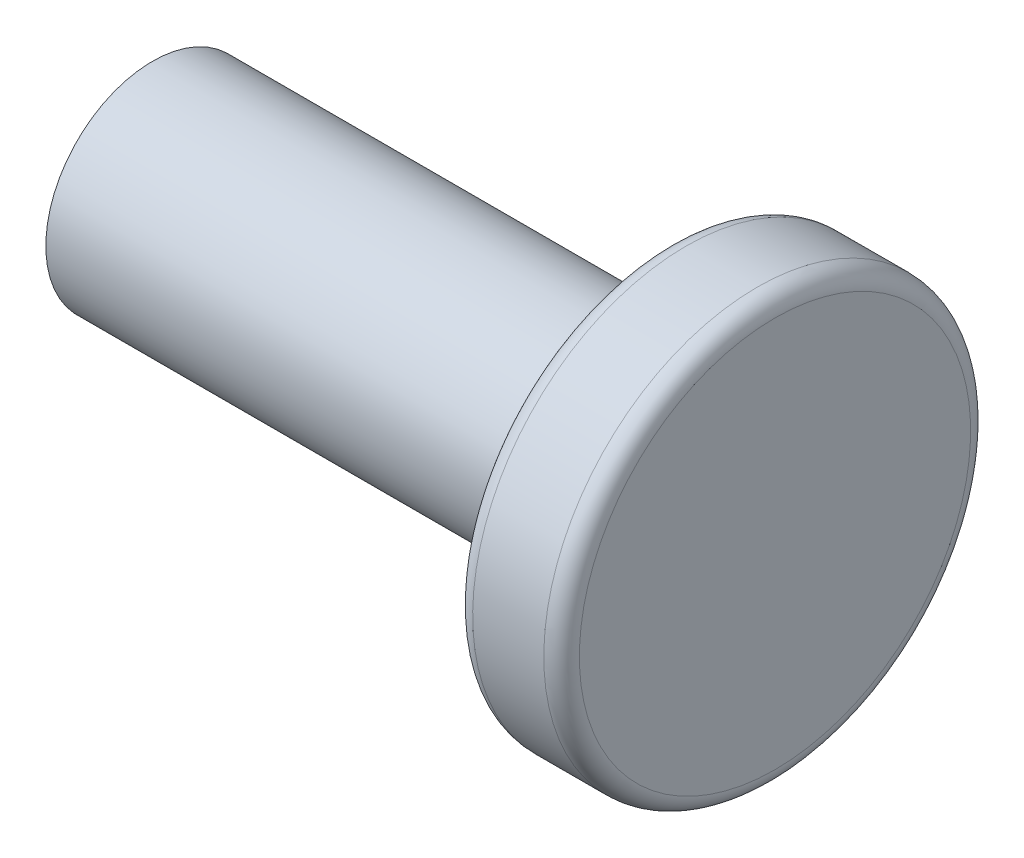
ISO-10303-21;
HEADER;
FILE_DESCRIPTION(('STEP AP214'),'2;1');
FILE_NAME('part.step','',(''),(''),'','','');
FILE_SCHEMA(('AUTOMOTIVE_DESIGN { 1 0 10303 214 1 1 1 1 }'));
ENDSEC;
DATA;
#1=APPLICATION_CONTEXT('core data for automotive mechanical design processes');
#2=APPLICATION_PROTOCOL_DEFINITION('international standard','automotive_design',2000,#1);
#3=PRODUCT_CONTEXT('',#1,'mechanical');
#4=PRODUCT('Part','Part','',(#3));
#5=PRODUCT_RELATED_PRODUCT_CATEGORY('part','',(#4));
#6=PRODUCT_DEFINITION_FORMATION('','',#4);
#7=PRODUCT_DEFINITION_CONTEXT('part definition',#1,'design');
#8=PRODUCT_DEFINITION('design','',#6,#7);
#9=PRODUCT_DEFINITION_SHAPE('','',#8);
#10=(LENGTH_UNIT() NAMED_UNIT(*) SI_UNIT(.MILLI.,.METRE.));
#11=(NAMED_UNIT(*) PLANE_ANGLE_UNIT() SI_UNIT($,.RADIAN.));
#12=(NAMED_UNIT(*) SI_UNIT($,.STERADIAN.) SOLID_ANGLE_UNIT());
#13=UNCERTAINTY_MEASURE_WITH_UNIT(LENGTH_MEASURE(1.E-05),#10,'distance_accuracy_value','');
#14=(GEOMETRIC_REPRESENTATION_CONTEXT(3) GLOBAL_UNCERTAINTY_ASSIGNED_CONTEXT((#13)) GLOBAL_UNIT_ASSIGNED_CONTEXT((#10,
#11,#12)) REPRESENTATION_CONTEXT('',''));
#15=CARTESIAN_POINT('',(0.,0.,0.));
#16=DIRECTION('',(0.,0.,1.));
#17=DIRECTION('',(1.,0.,0.));
#18=AXIS2_PLACEMENT_3D('',#15,#16,#17);
#19=CARTESIAN_POINT('',(588.394917120642,103.315701745268,-237.556360518351));
#20=DIRECTION('',(1.,0.,0.));
#21=DIRECTION('',(0.,0.,-1.));
#22=AXIS2_PLACEMENT_3D('',#19,#20,#21);
#23=PLANE('',#22);
#24=CARTESIAN_POINT('',(588.394917120642,100.315701745268,-237.556360518351));
#25=DIRECTION('',(-1.,0.,0.));
#26=DIRECTION('',(0.,1.,0.));
#27=AXIS2_PLACEMENT_3D('',#24,#25,#26);
#28=CIRCLE('',#27,5.49999999999999);
#29=CARTESIAN_POINT('',(588.394917120642,105.815701745268,-237.556360518351));
#30=VERTEX_POINT('',#29);
#31=CARTESIAN_POINT('',(588.394917120642,94.8157017452682,-237.556360518351));
#32=VERTEX_POINT('',#31);
#33=EDGE_CURVE('E45',#30,#32,#28,.T.);
#34=ORIENTED_EDGE('',*,*,#33,.F.);
#35=CARTESIAN_POINT('',(588.394917120642,100.315701745268,-237.556360518351));
#36=DIRECTION('',(-1.,0.,0.));
#37=DIRECTION('',(0.,-1.,0.));
#38=AXIS2_PLACEMENT_3D('',#35,#36,#37);
#39=CIRCLE('',#38,5.4999999999997);
#40=EDGE_CURVE('E48',#32,#30,#39,.T.);
#41=ORIENTED_EDGE('',*,*,#40,.F.);
#42=EDGE_LOOP('',(#34,#41));
#43=FACE_BOUND('',#42,.T.);
#44=ADVANCED_FACE('F17',(#43),#23,.T.);
#45=CARTESIAN_POINT('',(587.894917120642,100.315701745268,-237.556360518351));
#46=DIRECTION('',(1.,0.,0.));
#47=DIRECTION('',(0.,1.,0.));
#48=AXIS2_PLACEMENT_3D('',#45,#46,#47);
#49=TOROIDAL_SURFACE('',#48,5.49999999999996,0.5);
#50=CARTESIAN_POINT('',(587.894917120642,100.315701745268,-237.556360518351));
#51=DIRECTION('',(1.,0.,0.));
#52=DIRECTION('',(0.,0.,-1.));
#53=AXIS2_PLACEMENT_3D('',#50,#51,#52);
#54=CIRCLE('',#53,5.99999999999996);
#55=CARTESIAN_POINT('',(587.894917120642,100.315701745268,-243.556360518351));
#56=VERTEX_POINT('',#55);
#57=EDGE_CURVE('E55',#56,#56,#54,.F.);
#58=ORIENTED_EDGE('',*,*,#57,.F.);
#59=EDGE_LOOP('',(#58));
#60=FACE_BOUND('',#59,.T.);
#61=ORIENTED_EDGE('',*,*,#33,.T.);
#62=ORIENTED_EDGE('',*,*,#40,.T.);
#63=EDGE_LOOP('',(#61,#62));
#64=FACE_BOUND('',#63,.T.);
#65=ADVANCED_FACE('F54',(#60,#64),#49,.T.);
#66=CARTESIAN_POINT('',(586.894917120642,100.315701745268,-237.556360518351));
#67=DIRECTION('',(1.,0.,0.));
#68=DIRECTION('',(0.,0.,-1.));
#69=AXIS2_PLACEMENT_3D('',#66,#67,#68);
#70=CYLINDRICAL_SURFACE('',#69,5.99999999999996);
#71=ORIENTED_EDGE('',*,*,#57,.T.);
#72=EDGE_LOOP('',(#71));
#73=FACE_BOUND('',#72,.T.);
#74=CARTESIAN_POINT('',(585.894917120642,100.315701745268,-237.556360518351));
#75=DIRECTION('',(1.,0.,0.));
#76=DIRECTION('',(0.,1.,0.));
#77=AXIS2_PLACEMENT_3D('',#74,#75,#76);
#78=CIRCLE('',#77,5.99999999999996);
#79=CARTESIAN_POINT('',(585.894917120642,106.315701745268,-237.556360518351));
#80=VERTEX_POINT('',#79);
#81=EDGE_CURVE('E86',#80,#80,#78,.F.);
#82=ORIENTED_EDGE('',*,*,#81,.F.);
#83=EDGE_LOOP('',(#82));
#84=FACE_BOUND('',#83,.T.);
#85=ADVANCED_FACE('F71',(#73,#84),#70,.T.);
#86=CARTESIAN_POINT('',(585.894917120642,100.315701745268,-237.556360518351));
#87=DIRECTION('',(1.,0.,0.));
#88=DIRECTION('',(0.,1.,0.));
#89=AXIS2_PLACEMENT_3D('',#86,#87,#88);
#90=TOROIDAL_SURFACE('',#89,5.49999999999996,0.5);
#91=ORIENTED_EDGE('',*,*,#81,.T.);
#92=EDGE_LOOP('',(#91));
#93=FACE_BOUND('',#92,.T.);
#94=CARTESIAN_POINT('',(585.394917120642,100.315701745268,-237.556360518351));
#95=DIRECTION('',(1.,0.,0.));
#96=DIRECTION('',(0.,-1.,0.));
#97=AXIS2_PLACEMENT_3D('',#94,#95,#96);
#98=CIRCLE('',#97,5.49999999999982);
#99=CARTESIAN_POINT('',(585.394917120642,94.8157017452682,-237.556360518351));
#100=VERTEX_POINT('',#99);
#101=CARTESIAN_POINT('',(585.394917120642,105.815701745268,-237.556360518351));
#102=VERTEX_POINT('',#101);
#103=EDGE_CURVE('E119',#100,#102,#98,.T.);
#104=ORIENTED_EDGE('',*,*,#103,.T.);
#105=CARTESIAN_POINT('',(585.394917120642,100.315701745268,-237.556360518351));
#106=DIRECTION('',(1.,0.,0.));
#107=DIRECTION('',(0.,1.,0.));
#108=AXIS2_PLACEMENT_3D('',#105,#106,#107);
#109=CIRCLE('',#108,5.49999999999998);
#110=EDGE_CURVE('E36',#102,#100,#109,.T.);
#111=ORIENTED_EDGE('',*,*,#110,.T.);
#112=EDGE_LOOP('',(#104,#111));
#113=FACE_BOUND('',#112,.T.);
#114=ADVANCED_FACE('F93',(#93,#113),#90,.T.);
#115=CARTESIAN_POINT('',(585.394917120642,104.815701745268,-237.556360518351));
#116=DIRECTION('',(1.,0.,0.));
#117=DIRECTION('',(0.,0.,-1.));
#118=AXIS2_PLACEMENT_3D('',#115,#116,#117);
#119=PLANE('',#118);
#120=ORIENTED_EDGE('',*,*,#110,.F.);
#121=ORIENTED_EDGE('',*,*,#103,.F.);
#122=EDGE_LOOP('',(#120,#121));
#123=FACE_BOUND('',#122,.T.);
#124=CARTESIAN_POINT('',(585.394917120642,100.315701745268,-237.556360518351));
#125=DIRECTION('',(1.,0.,0.));
#126=DIRECTION('',(0.,0.,-1.));
#127=AXIS2_PLACEMENT_3D('',#124,#125,#126);
#128=CIRCLE('',#127,2.99999999999996);
#129=CARTESIAN_POINT('',(585.394917120642,100.315701745268,-240.556360518351));
#130=VERTEX_POINT('',#129);
#131=EDGE_CURVE('E28',#130,#130,#128,.F.);
#132=ORIENTED_EDGE('',*,*,#131,.F.);
#133=EDGE_LOOP('',(#132));
#134=FACE_BOUND('',#133,.T.);
#135=ADVANCED_FACE('F102',(#123,#134),#119,.F.);
#136=CARTESIAN_POINT('',(570.894917120642,101.815701745268,-237.556360518351));
#137=DIRECTION('',(1.,0.,0.));
#138=DIRECTION('',(0.,0.,-1.));
#139=AXIS2_PLACEMENT_3D('',#136,#137,#138);
#140=PLANE('',#139);
#141=CARTESIAN_POINT('',(570.894917120642,100.315701745268,-237.556360518351));
#142=DIRECTION('',(1.,0.,0.));
#143=DIRECTION('',(0.,0.,-1.));
#144=AXIS2_PLACEMENT_3D('',#141,#142,#143);
#145=CIRCLE('',#144,2.99999999999996);
#146=CARTESIAN_POINT('',(570.894917120642,100.315701745268,-240.556360518351));
#147=VERTEX_POINT('',#146);
#148=EDGE_CURVE('E11',#147,#147,#145,.T.);
#149=ORIENTED_EDGE('',*,*,#148,.F.);
#150=EDGE_LOOP('',(#149));
#151=FACE_BOUND('',#150,.T.);
#152=ADVANCED_FACE('F142',(#151),#140,.F.);
#153=CARTESIAN_POINT('',(578.144917120642,100.315701745268,-237.556360518351));
#154=DIRECTION('',(1.,0.,0.));
#155=DIRECTION('',(0.,0.,-1.));
#156=AXIS2_PLACEMENT_3D('',#153,#154,#155);
#157=CYLINDRICAL_SURFACE('',#156,2.99999999999996);
#158=ORIENTED_EDGE('',*,*,#148,.T.);
#159=EDGE_LOOP('',(#158));
#160=FACE_BOUND('',#159,.T.);
#161=ORIENTED_EDGE('',*,*,#131,.T.);
#162=EDGE_LOOP('',(#161));
#163=FACE_BOUND('',#162,.T.);
#164=ADVANCED_FACE('F140',(#160,#163),#157,.T.);
#165=CLOSED_SHELL('',(#44,#65,#85,#114,#135,#152,#164));
#166=MANIFOLD_SOLID_BREP('B1',#165);
#167=ADVANCED_BREP_SHAPE_REPRESENTATION('',(#18,#166),#14);
#168=SHAPE_DEFINITION_REPRESENTATION(#9,#167);
ENDSEC;
END-ISO-10303-21;
